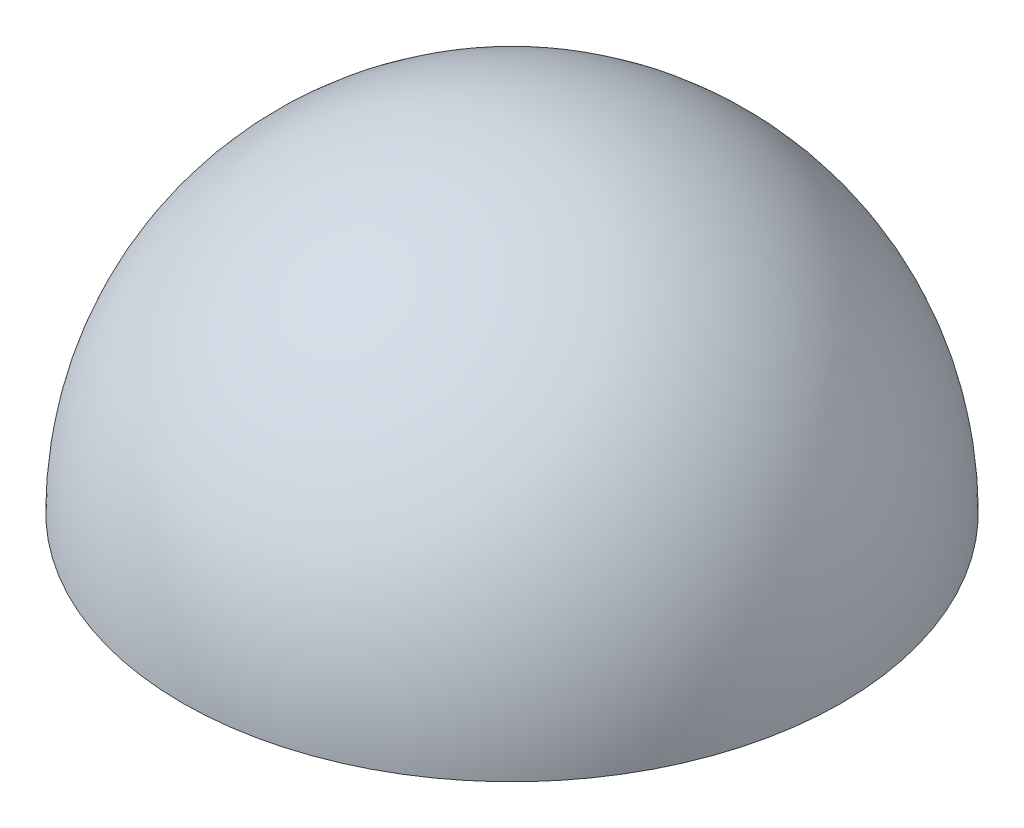
ISO-10303-21;
HEADER;
FILE_DESCRIPTION(('STEP AP214'),'2;1');
FILE_NAME('part.step','',(''),(''),'','','');
FILE_SCHEMA(('AUTOMOTIVE_DESIGN { 1 0 10303 214 1 1 1 1 }'));
ENDSEC;
DATA;
#1=APPLICATION_CONTEXT('core data for automotive mechanical design processes');
#2=APPLICATION_PROTOCOL_DEFINITION('international standard','automotive_design',2000,#1);
#3=PRODUCT_CONTEXT('',#1,'mechanical');
#4=PRODUCT('Part','Part','',(#3));
#5=PRODUCT_RELATED_PRODUCT_CATEGORY('part','',(#4));
#6=PRODUCT_DEFINITION_FORMATION('','',#4);
#7=PRODUCT_DEFINITION_CONTEXT('part definition',#1,'design');
#8=PRODUCT_DEFINITION('design','',#6,#7);
#9=PRODUCT_DEFINITION_SHAPE('','',#8);
#10=(LENGTH_UNIT() NAMED_UNIT(*) SI_UNIT(.MILLI.,.METRE.));
#11=(NAMED_UNIT(*) PLANE_ANGLE_UNIT() SI_UNIT($,.RADIAN.));
#12=(NAMED_UNIT(*) SI_UNIT($,.STERADIAN.) SOLID_ANGLE_UNIT());
#13=UNCERTAINTY_MEASURE_WITH_UNIT(LENGTH_MEASURE(1.E-05),#10,'distance_accuracy_value','');
#14=(GEOMETRIC_REPRESENTATION_CONTEXT(3) GLOBAL_UNCERTAINTY_ASSIGNED_CONTEXT((#13)) GLOBAL_UNIT_ASSIGNED_CONTEXT((#10,
#11,#12)) REPRESENTATION_CONTEXT('',''));
#15=CARTESIAN_POINT('',(0.,0.,0.));
#16=DIRECTION('',(0.,0.,1.));
#17=DIRECTION('',(1.,0.,0.));
#18=AXIS2_PLACEMENT_3D('',#15,#16,#17);
#19=CARTESIAN_POINT('',(0.,0.,0.));
#20=DIRECTION('',(0.,1.,0.));
#21=DIRECTION('',(0.,0.,1.));
#22=AXIS2_PLACEMENT_3D('',#19,#20,#21);
#23=PLANE('',#22);
#24=CARTESIAN_POINT('',(0.,0.,0.));
#25=DIRECTION('',(0.,-1.,0.));
#26=DIRECTION('',(0.,0.,-1.));
#27=AXIS2_PLACEMENT_3D('',#24,#25,#26);
#28=CIRCLE('',#27,70.);
#29=CARTESIAN_POINT('',(0.,0.,-70.));
#30=VERTEX_POINT('',#29);
#31=EDGE_CURVE('E10',#30,#30,#28,.T.);
#32=ORIENTED_EDGE('',*,*,#31,.T.);
#33=EDGE_LOOP('',(#32));
#34=FACE_BOUND('',#33,.T.);
#35=ADVANCED_FACE('F33',(#34),#23,.F.);
#36=CARTESIAN_POINT('',(0.,0.,0.));
#37=DIRECTION('',(0.,-1.,0.));
#38=DIRECTION('',(-1.,0.,0.));
#39=AXIS2_PLACEMENT_3D('',#36,#37,#38);
#40=SPHERICAL_SURFACE('',#39,70.);
#41=ORIENTED_EDGE('',*,*,#31,.F.);
#42=EDGE_LOOP('',(#41));
#43=FACE_BOUND('',#42,.T.);
#44=ADVANCED_FACE('F41',(#43),#40,.T.);
#45=CLOSED_SHELL('',(#35,#44));
#46=MANIFOLD_SOLID_BREP('B2',#45);
#47=ADVANCED_BREP_SHAPE_REPRESENTATION('',(#18,#46),#14);
#48=SHAPE_DEFINITION_REPRESENTATION(#9,#47);
ENDSEC;
END-ISO-10303-21;
